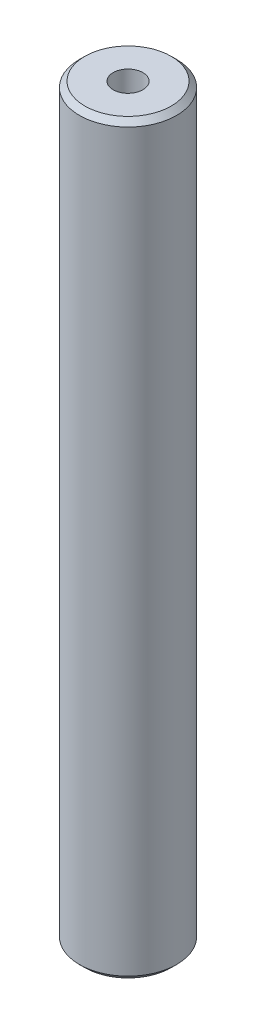
ISO-10303-21;
HEADER;
FILE_DESCRIPTION(('STEP AP214'),'2;1');
FILE_NAME('part.step','',(''),(''),'','','');
FILE_SCHEMA(('AUTOMOTIVE_DESIGN { 1 0 10303 214 1 1 1 1 }'));
ENDSEC;
DATA;
#1=APPLICATION_CONTEXT('core data for automotive mechanical design processes');
#2=APPLICATION_PROTOCOL_DEFINITION('international standard','automotive_design',2000,#1);
#3=PRODUCT_CONTEXT('',#1,'mechanical');
#4=PRODUCT('Part','Part','',(#3));
#5=PRODUCT_RELATED_PRODUCT_CATEGORY('part','',(#4));
#6=PRODUCT_DEFINITION_FORMATION('','',#4);
#7=PRODUCT_DEFINITION_CONTEXT('part definition',#1,'design');
#8=PRODUCT_DEFINITION('design','',#6,#7);
#9=PRODUCT_DEFINITION_SHAPE('','',#8);
#10=(LENGTH_UNIT() NAMED_UNIT(*) SI_UNIT(.MILLI.,.METRE.));
#11=(NAMED_UNIT(*) PLANE_ANGLE_UNIT() SI_UNIT($,.RADIAN.));
#12=(NAMED_UNIT(*) SI_UNIT($,.STERADIAN.) SOLID_ANGLE_UNIT());
#13=UNCERTAINTY_MEASURE_WITH_UNIT(LENGTH_MEASURE(1.E-05),#10,'distance_accuracy_value','');
#14=(GEOMETRIC_REPRESENTATION_CONTEXT(3) GLOBAL_UNCERTAINTY_ASSIGNED_CONTEXT((#13)) GLOBAL_UNIT_ASSIGNED_CONTEXT((#10,
#11,#12)) REPRESENTATION_CONTEXT('',''));
#15=CARTESIAN_POINT('',(0.,0.,0.));
#16=DIRECTION('',(0.,0.,1.));
#17=DIRECTION('',(1.,0.,0.));
#18=AXIS2_PLACEMENT_3D('',#15,#16,#17);
#19=CARTESIAN_POINT('',(0.,230.461337918801,0.));
#20=DIRECTION('',(0.,-1.,0.));
#21=DIRECTION('',(0.,0.,-1.));
#22=AXIS2_PLACEMENT_3D('',#19,#20,#21);
#23=CYLINDRICAL_SURFACE('',#22,15.);
#24=CARTESIAN_POINT('',(0.,228.78937708005,0.));
#25=DIRECTION('',(0.,1.,0.));
#26=DIRECTION('',(0.,0.,1.));
#27=AXIS2_PLACEMENT_3D('',#24,#25,#26);
#28=CIRCLE('',#27,15.);
#29=CARTESIAN_POINT('',(0.,228.78937708005,-15.));
#30=VERTEX_POINT('',#29);
#31=EDGE_CURVE('E50',#30,#30,#28,.F.);
#32=CARTESIAN_POINT('',(0.,1.67196083875093,0.));
#33=DIRECTION('',(0.,1.,0.));
#34=DIRECTION('',(0.,0.,1.));
#35=AXIS2_PLACEMENT_3D('',#32,#33,#34);
#36=CIRCLE('',#35,15.);
#37=CARTESIAN_POINT('',(0.,1.6719608387509,-15.));
#38=VERTEX_POINT('',#37);
#39=EDGE_CURVE('E51',#38,#38,#36,.T.);
#40=CARTESIAN_POINT('',(0.,228.78937708005,-15.));
#41=CARTESIAN_POINT('',(0.,226.42357066087,-15.));
#42=CARTESIAN_POINT('',(0.,224.05776424169,-15.));
#43=CARTESIAN_POINT('',(0.,219.326151403329,-15.));
#44=CARTESIAN_POINT('',(0.,216.960344984149,-15.));
#45=CARTESIAN_POINT('',(0.,212.228732145789,-15.));
#46=CARTESIAN_POINT('',(0.,209.862925726609,-15.));
#47=CARTESIAN_POINT('',(0.,205.131312888248,-15.));
#48=CARTESIAN_POINT('',(0.,202.765506469068,-15.));
#49=CARTESIAN_POINT('',(0.,198.033893630708,-15.));
#50=CARTESIAN_POINT('',(0.,195.668087211527,-15.));
#51=CARTESIAN_POINT('',(0.,190.936474373167,-15.));
#52=CARTESIAN_POINT('',(0.,188.570667953987,-15.));
#53=CARTESIAN_POINT('',(0.,183.839055115626,-15.));
#54=CARTESIAN_POINT('',(0.,181.473248696446,-15.));
#55=CARTESIAN_POINT('',(0.,176.741635858086,-15.));
#56=CARTESIAN_POINT('',(0.,174.375829438906,-15.));
#57=CARTESIAN_POINT('',(0.,169.644216600545,-15.));
#58=CARTESIAN_POINT('',(0.,167.278410181365,-15.));
#59=CARTESIAN_POINT('',(0.,162.546797343005,-15.));
#60=CARTESIAN_POINT('',(0.,160.180990923824,-15.));
#61=CARTESIAN_POINT('',(0.,155.449378085464,-15.));
#62=CARTESIAN_POINT('',(0.,153.083571666284,-15.));
#63=CARTESIAN_POINT('',(0.,148.351958827923,-15.));
#64=CARTESIAN_POINT('',(0.,145.986152408743,-15.));
#65=CARTESIAN_POINT('',(0.,141.254539570383,-15.));
#66=CARTESIAN_POINT('',(0.,138.888733151203,-15.));
#67=CARTESIAN_POINT('',(0.,134.157120312842,-15.));
#68=CARTESIAN_POINT('',(0.,131.791313893662,-15.));
#69=CARTESIAN_POINT('',(0.,127.059701055302,-15.));
#70=CARTESIAN_POINT('',(0.,124.693894636121,-15.));
#71=CARTESIAN_POINT('',(0.,119.962281797761,-15.));
#72=CARTESIAN_POINT('',(0.,117.596475378581,-15.));
#73=CARTESIAN_POINT('',(0.,112.86486254022,-15.));
#74=CARTESIAN_POINT('',(0.,110.49905612104,-15.));
#75=CARTESIAN_POINT('',(0.,105.76744328268,-15.));
#76=CARTESIAN_POINT('',(0.,103.4016368635,-15.));
#77=CARTESIAN_POINT('',(0.,98.6700240251392,-15.));
#78=CARTESIAN_POINT('',(0.,96.3042176059589,-15.));
#79=CARTESIAN_POINT('',(0.,91.5726047675985,-15.));
#80=CARTESIAN_POINT('',(0.,89.2067983484183,-15.));
#81=CARTESIAN_POINT('',(0.,84.4751855100579,-15.));
#82=CARTESIAN_POINT('',(0.,82.1093790908778,-15.));
#83=CARTESIAN_POINT('',(0.,77.3777662525173,-15.));
#84=CARTESIAN_POINT('',(0.,75.0119598333371,-15.));
#85=CARTESIAN_POINT('',(0.,70.2803469949767,-15.));
#86=CARTESIAN_POINT('',(0.,67.9145405757965,-15.));
#87=CARTESIAN_POINT('',(0.,63.1829277374361,-15.));
#88=CARTESIAN_POINT('',(0.,60.8171213182559,-15.));
#89=CARTESIAN_POINT('',(0.,56.0855084798955,-15.));
#90=CARTESIAN_POINT('',(0.,53.7197020607153,-15.));
#91=CARTESIAN_POINT('',(0.,48.9880892223549,-15.));
#92=CARTESIAN_POINT('',(0.,46.6222828031747,-15.));
#93=CARTESIAN_POINT('',(0.,41.8906699648143,-15.));
#94=CARTESIAN_POINT('',(0.,39.5248635456341,-15.));
#95=CARTESIAN_POINT('',(0.,34.7932507072737,-15.));
#96=CARTESIAN_POINT('',(0.,32.4274442880935,-15.));
#97=CARTESIAN_POINT('',(0.,27.6958314497331,-15.));
#98=CARTESIAN_POINT('',(0.,25.3300250305529,-15.));
#99=CARTESIAN_POINT('',(0.,20.5984121921925,-15.));
#100=CARTESIAN_POINT('',(0.,18.2326057730123,-15.));
#101=CARTESIAN_POINT('',(0.,13.5009929346519,-15.));
#102=CARTESIAN_POINT('',(0.,11.1351865154717,-15.));
#103=CARTESIAN_POINT('',(0.,6.4035736771113,-15.));
#104=CARTESIAN_POINT('',(0.,4.0377672579311,-15.));
#105=CARTESIAN_POINT('',(0.,1.6719608387509,-15.));
#106=B_SPLINE_CURVE_WITH_KNOTS('',3,(#40,#41,#42,#43,#44,#45,#46,#47,#48,#49,#50,#51,#52,#53,
#54,#55,#56,#57,#58,#59,#60,#61,#62,#63,#64,#65,#66,#67,#68,#69,#70,#71,#72,#73,#74,#75,#76,#77,
#78,#79,#80,#81,#82,#83,#84,#85,#86,#87,#88,#89,#90,#91,#92,#93,#94,#95,#96,#97,#98,#99,#100,
#101,#102,#103,#104,#105),.UNSPECIFIED.,.F.,.F.,(4,2,2,2,2,2,2,2,2,2,2,2,2,2,2,2,2,2,2,2,2,2,2,
2,2,2,2,2,2,2,2,2,4),(0.,7.09741925754059,14.1948385150812,21.2922577726218,28.3896770301624,
35.487096287703,42.5845155452436,49.6819348027842,56.7793540603248,63.8767733178654,
70.974192575406,78.0716118329466,85.1690310904872,92.2664503480278,99.3638696055684,
106.461288863109,113.55870812065,120.65612737819,127.753546635731,134.850965893271,
141.948385150812,149.045804408353,156.143223665893,163.240642923434,170.338062180974,
177.435481438515,184.532900696056,191.630319953596,198.727739211137,205.825158468677,
212.922577726218,220.019996983759,227.117416241299),.UNSPECIFIED.);
#107=EDGE_CURVE('BSEAM39',#30,#38,#106,.T.);
#108=ORIENTED_EDGE('',*,*,#31,.T.);
#109=ORIENTED_EDGE('',*,*,#39,.T.);
#110=ORIENTED_EDGE('',*,*,#107,.T.);
#111=ORIENTED_EDGE('',*,*,#107,.F.);
#112=EDGE_LOOP('',(#108,#110,#109,#111));
#113=FACE_BOUND('',#112,.T.);
#114=ADVANCED_FACE('F39',(#113),#23,.T.);
#115=CARTESIAN_POINT('',(0.,230.461337918801,0.));
#116=DIRECTION('',(0.,1.,0.));
#117=DIRECTION('',(0.,0.,1.));
#118=AXIS2_PLACEMENT_3D('',#115,#116,#117);
#119=PLANE('',#118);
#120=CARTESIAN_POINT('',(0.,230.461337918801,0.));
#121=DIRECTION('',(0.,1.,0.));
#122=DIRECTION('',(0.,0.,1.));
#123=AXIS2_PLACEMENT_3D('',#120,#121,#122);
#124=CIRCLE('',#123,13.3280391612493);
#125=CARTESIAN_POINT('',(0.,230.461337918801,13.3280391612493));
#126=VERTEX_POINT('',#125);
#127=EDGE_CURVE('E54',#126,#126,#124,.T.);
#128=ORIENTED_EDGE('',*,*,#127,.T.);
#129=EDGE_LOOP('',(#128));
#130=FACE_BOUND('',#129,.T.);
#131=CARTESIAN_POINT('',(0.,230.461337918801,0.));
#132=DIRECTION('',(0.,1.,0.));
#133=DIRECTION('',(0.,0.,1.));
#134=AXIS2_PLACEMENT_3D('',#131,#132,#133);
#135=CIRCLE('',#134,4.59925425108579);
#136=CARTESIAN_POINT('',(0.,230.461337918801,-4.59925425108579));
#137=VERTEX_POINT('',#136);
#138=EDGE_CURVE('E58',#137,#137,#135,.T.);
#139=ORIENTED_EDGE('',*,*,#138,.F.);
#140=EDGE_LOOP('',(#139));
#141=FACE_BOUND('',#140,.T.);
#142=ADVANCED_FACE('F69',(#130,#141),#119,.T.);
#143=CARTESIAN_POINT('',(0.,0.,0.));
#144=DIRECTION('',(0.,1.,0.));
#145=DIRECTION('',(0.,0.,1.));
#146=AXIS2_PLACEMENT_3D('',#143,#144,#145);
#147=PLANE('',#146);
#148=CARTESIAN_POINT('',(0.,0.,0.));
#149=DIRECTION('',(0.,1.,0.));
#150=DIRECTION('',(0.,0.,1.));
#151=AXIS2_PLACEMENT_3D('',#148,#149,#150);
#152=CIRCLE('',#151,13.3280391612491);
#153=CARTESIAN_POINT('',(0.,0.,13.3280391612491));
#154=VERTEX_POINT('',#153);
#155=EDGE_CURVE('E10',#154,#154,#152,.F.);
#156=ORIENTED_EDGE('',*,*,#155,.T.);
#157=EDGE_LOOP('',(#156));
#158=FACE_BOUND('',#157,.T.);
#159=CARTESIAN_POINT('',(0.,0.,0.));
#160=DIRECTION('',(0.,1.,0.));
#161=DIRECTION('',(0.,0.,1.));
#162=AXIS2_PLACEMENT_3D('',#159,#160,#161);
#163=CIRCLE('',#162,4.59925425108579);
#164=CARTESIAN_POINT('',(0.,0.,-4.59925425108579));
#165=VERTEX_POINT('',#164);
#166=EDGE_CURVE('E63',#165,#165,#163,.T.);
#167=ORIENTED_EDGE('',*,*,#166,.T.);
#168=EDGE_LOOP('',(#167));
#169=FACE_BOUND('',#168,.T.);
#170=ADVANCED_FACE('F75',(#158,#169),#147,.F.);
#171=CARTESIAN_POINT('',(0.,230.461337918801,0.));
#172=DIRECTION('',(0.,-1.,0.));
#173=DIRECTION('',(0.,0.,-1.));
#174=AXIS2_PLACEMENT_3D('',#171,#172,#173);
#175=CYLINDRICAL_SURFACE('',#174,4.59925425108579);
#176=CARTESIAN_POINT('',(0.,230.461337918801,-4.59925425108579));
#177=CARTESIAN_POINT('',(0.,228.060698982147,-4.59925425108579));
#178=CARTESIAN_POINT('',(0.,225.660060045493,-4.59925425108579));
#179=CARTESIAN_POINT('',(0.,220.858782172184,-4.59925425108579));
#180=CARTESIAN_POINT('',(0.,218.45814323553,-4.59925425108579));
#181=CARTESIAN_POINT('',(0.,213.656865362222,-4.59925425108579));
#182=CARTESIAN_POINT('',(0.,211.256226425567,-4.59925425108579));
#183=CARTESIAN_POINT('',(0.,206.454948552259,-4.59925425108579));
#184=CARTESIAN_POINT('',(0.,204.054309615605,-4.59925425108579));
#185=CARTESIAN_POINT('',(0.,199.253031742297,-4.59925425108579));
#186=CARTESIAN_POINT('',(0.,196.852392805642,-4.59925425108579));
#187=CARTESIAN_POINT('',(0.,192.051114932334,-4.59925425108579));
#188=CARTESIAN_POINT('',(0.,189.65047599568,-4.59925425108579));
#189=CARTESIAN_POINT('',(0.,184.849198122372,-4.59925425108579));
#190=CARTESIAN_POINT('',(0.,182.448559185717,-4.59925425108579));
#191=CARTESIAN_POINT('',(0.,177.647281312409,-4.59925425108579));
#192=CARTESIAN_POINT('',(0.,175.246642375755,-4.59925425108579));
#193=CARTESIAN_POINT('',(0.,170.445364502446,-4.59925425108579));
#194=CARTESIAN_POINT('',(0.,168.044725565792,-4.59925425108579));
#195=CARTESIAN_POINT('',(0.,163.243447692484,-4.59925425108579));
#196=CARTESIAN_POINT('',(0.,160.84280875583,-4.59925425108579));
#197=CARTESIAN_POINT('',(0.,156.041530882521,-4.59925425108579));
#198=CARTESIAN_POINT('',(0.,153.640891945867,-4.59925425108579));
#199=CARTESIAN_POINT('',(0.,148.839614072559,-4.59925425108579));
#200=CARTESIAN_POINT('',(0.,146.438975135905,-4.59925425108579));
#201=CARTESIAN_POINT('',(0.,141.637697262596,-4.59925425108579));
#202=CARTESIAN_POINT('',(0.,139.237058325942,-4.59925425108579));
#203=CARTESIAN_POINT('',(0.,134.435780452634,-4.59925425108579));
#204=CARTESIAN_POINT('',(0.,132.03514151598,-4.59925425108579));
#205=CARTESIAN_POINT('',(0.,127.233863642671,-4.59925425108579));
#206=CARTESIAN_POINT('',(0.,124.833224706017,-4.59925425108579));
#207=CARTESIAN_POINT('',(0.,120.031946832709,-4.59925425108579));
#208=CARTESIAN_POINT('',(0.,117.631307896055,-4.59925425108579));
#209=CARTESIAN_POINT('',(0.,112.830030022746,-4.59925425108579));
#210=CARTESIAN_POINT('',(0.,110.429391086092,-4.59925425108579));
#211=CARTESIAN_POINT('',(0.,105.628113212784,-4.59925425108579));
#212=CARTESIAN_POINT('',(0.,103.22747427613,-4.59925425108579));
#213=CARTESIAN_POINT('',(0.,98.4261964028212,-4.59925425108579));
#214=CARTESIAN_POINT('',(0.,96.025557466167,-4.59925425108579));
#215=CARTESIAN_POINT('',(0.,91.2242795928587,-4.59925425108579));
#216=CARTESIAN_POINT('',(0.,88.8236406562045,-4.59925425108579));
#217=CARTESIAN_POINT('',(0.,84.0223627828962,-4.59925425108579));
#218=CARTESIAN_POINT('',(0.,81.621723846242,-4.59925425108579));
#219=CARTESIAN_POINT('',(0.,76.8204459729336,-4.59925425108579));
#220=CARTESIAN_POINT('',(0.,74.4198070362795,-4.59925425108579));
#221=CARTESIAN_POINT('',(0.,69.6185291629711,-4.59925425108579));
#222=CARTESIAN_POINT('',(0.,67.2178902263169,-4.59925425108579));
#223=CARTESIAN_POINT('',(0.,62.4166123530086,-4.59925425108579));
#224=CARTESIAN_POINT('',(0.,60.0159734163544,-4.59925425108579));
#225=CARTESIAN_POINT('',(0.,55.214695543046,-4.59925425108579));
#226=CARTESIAN_POINT('',(0.,52.8140566063919,-4.59925425108579));
#227=CARTESIAN_POINT('',(0.,48.0127787330835,-4.59925425108579));
#228=CARTESIAN_POINT('',(0.,45.6121397964293,-4.59925425108579));
#229=CARTESIAN_POINT('',(0.,40.810861923121,-4.59925425108579));
#230=CARTESIAN_POINT('',(0.,38.4102229864668,-4.59925425108579));
#231=CARTESIAN_POINT('',(0.,33.6089451131584,-4.59925425108579));
#232=CARTESIAN_POINT('',(0.,31.2083061765043,-4.59925425108579));
#233=CARTESIAN_POINT('',(0.,26.4070283031959,-4.59925425108579));
#234=CARTESIAN_POINT('',(0.,24.0063893665418,-4.59925425108579));
#235=CARTESIAN_POINT('',(0.,19.2051114932334,-4.59925425108579));
#236=CARTESIAN_POINT('',(0.,16.8044725565792,-4.59925425108579));
#237=CARTESIAN_POINT('',(0.,12.0031946832709,-4.59925425108579));
#238=CARTESIAN_POINT('',(0.,9.60255574661667,-4.59925425108579));
#239=CARTESIAN_POINT('',(0.,4.80127787330832,-4.59925425108579));
#240=CARTESIAN_POINT('',(0.,2.40063893665414,-4.59925425108579));
#241=CARTESIAN_POINT('',(0.,0.,-4.59925425108579));
#242=B_SPLINE_CURVE_WITH_KNOTS('',3,(#176,#177,#178,#179,#180,#181,#182,#183,#184,#185,#186,
#187,#188,#189,#190,#191,#192,#193,#194,#195,#196,#197,#198,#199,#200,#201,#202,#203,#204,#205,
#206,#207,#208,#209,#210,#211,#212,#213,#214,#215,#216,#217,#218,#219,#220,#221,#222,#223,#224,
#225,#226,#227,#228,#229,#230,#231,#232,#233,#234,#235,#236,#237,#238,#239,#240,#241),
.UNSPECIFIED.,.F.,.F.,(4,2,2,2,2,2,2,2,2,2,2,2,2,2,2,2,2,2,2,2,2,2,2,2,2,2,2,2,2,2,2,2,4),(0.,
7.20191680996254,14.4038336199251,21.6057504298876,28.8076672398501,36.0095840498127,
43.2115008597752,50.4134176697377,57.6153344797002,64.8172512896628,72.0191680996253,
79.2210849095878,86.4230017195504,93.6249185295129,100.826835339475,108.028752149438,
115.2306689594,122.432585769363,129.634502579326,136.836419389288,144.038336199251,
151.240253009213,158.442169819176,165.644086629138,172.846003439101,180.047920249063,
187.249837059026,194.451753868988,201.653670678951,208.855587488913,216.057504298876,
223.259421108838,230.461337918801),.UNSPECIFIED.);
#243=EDGE_CURVE('BSEAM70',#137,#165,#242,.T.);
#244=ORIENTED_EDGE('',*,*,#138,.T.);
#245=ORIENTED_EDGE('',*,*,#166,.F.);
#246=ORIENTED_EDGE('',*,*,#243,.T.);
#247=ORIENTED_EDGE('',*,*,#243,.F.);
#248=EDGE_LOOP('',(#244,#246,#245,#247));
#249=FACE_BOUND('',#248,.T.);
#250=ADVANCED_FACE('F70',(#249),#175,.F.);
#251=CARTESIAN_POINT('',(0.,230.461337918801,0.));
#252=DIRECTION('',(0.,-1.,0.));
#253=DIRECTION('',(0.,0.,-1.));
#254=AXIS2_PLACEMENT_3D('',#251,#252,#253);
#255=CONICAL_SURFACE('',#254,13.3280391612493,0.785398163397445);
#256=ORIENTED_EDGE('',*,*,#31,.F.);
#257=EDGE_LOOP('',(#256));
#258=FACE_BOUND('',#257,.T.);
#259=ORIENTED_EDGE('',*,*,#127,.F.);
#260=EDGE_LOOP('',(#259));
#261=FACE_BOUND('',#260,.T.);
#262=ADVANCED_FACE('F81',(#258,#261),#255,.T.);
#263=CARTESIAN_POINT('',(0.,1.67196083875093,0.));
#264=DIRECTION('',(0.,1.,0.));
#265=DIRECTION('',(0.,0.,1.));
#266=AXIS2_PLACEMENT_3D('',#263,#264,#265);
#267=CONICAL_SURFACE('',#266,15.,0.785398163397445);
#268=ORIENTED_EDGE('',*,*,#155,.F.);
#269=EDGE_LOOP('',(#268));
#270=FACE_BOUND('',#269,.T.);
#271=ORIENTED_EDGE('',*,*,#39,.F.);
#272=EDGE_LOOP('',(#271));
#273=FACE_BOUND('',#272,.T.);
#274=ADVANCED_FACE('F45',(#270,#273),#267,.T.);
#275=CLOSED_SHELL('',(#114,#142,#170,#250,#262,#274));
#276=MANIFOLD_SOLID_BREP('B2',#275);
#277=ADVANCED_BREP_SHAPE_REPRESENTATION('',(#18,#276),#14);
#278=SHAPE_DEFINITION_REPRESENTATION(#9,#277);
ENDSEC;
END-ISO-10303-21;
